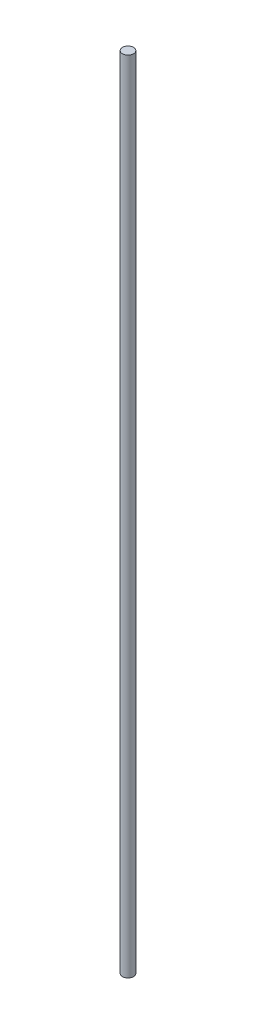
ISO-10303-21;
HEADER;
FILE_DESCRIPTION(('STEP AP214'),'2;1');
FILE_NAME('part.step','',(''),(''),'','','');
FILE_SCHEMA(('AUTOMOTIVE_DESIGN { 1 0 10303 214 1 1 1 1 }'));
ENDSEC;
DATA;
#1=APPLICATION_CONTEXT('core data for automotive mechanical design processes');
#2=APPLICATION_PROTOCOL_DEFINITION('international standard','automotive_design',2000,#1);
#3=PRODUCT_CONTEXT('',#1,'mechanical');
#4=PRODUCT('Part','Part','',(#3));
#5=PRODUCT_RELATED_PRODUCT_CATEGORY('part','',(#4));
#6=PRODUCT_DEFINITION_FORMATION('','',#4);
#7=PRODUCT_DEFINITION_CONTEXT('part definition',#1,'design');
#8=PRODUCT_DEFINITION('design','',#6,#7);
#9=PRODUCT_DEFINITION_SHAPE('','',#8);
#10=(LENGTH_UNIT() NAMED_UNIT(*) SI_UNIT(.MILLI.,.METRE.));
#11=(NAMED_UNIT(*) PLANE_ANGLE_UNIT() SI_UNIT($,.RADIAN.));
#12=(NAMED_UNIT(*) SI_UNIT($,.STERADIAN.) SOLID_ANGLE_UNIT());
#13=UNCERTAINTY_MEASURE_WITH_UNIT(LENGTH_MEASURE(1.E-05),#10,'distance_accuracy_value','');
#14=(GEOMETRIC_REPRESENTATION_CONTEXT(3) GLOBAL_UNCERTAINTY_ASSIGNED_CONTEXT((#13)) GLOBAL_UNIT_ASSIGNED_CONTEXT((#10,
#11,#12)) REPRESENTATION_CONTEXT('',''));
#15=CARTESIAN_POINT('',(0.,0.,0.));
#16=DIRECTION('',(0.,0.,1.));
#17=DIRECTION('',(1.,0.,0.));
#18=AXIS2_PLACEMENT_3D('',#15,#16,#17);
#19=CARTESIAN_POINT('',(0.,228.6,0.));
#20=DIRECTION('',(0.,-1.,0.));
#21=DIRECTION('',(0.,0.,-1.));
#22=AXIS2_PLACEMENT_3D('',#19,#20,#21);
#23=CYLINDRICAL_SURFACE('',#22,1.5875);
#24=CARTESIAN_POINT('',(0.,228.6,0.));
#25=DIRECTION('',(0.,1.,0.));
#26=DIRECTION('',(0.,0.,1.));
#27=AXIS2_PLACEMENT_3D('',#24,#25,#26);
#28=CIRCLE('',#27,1.5875);
#29=CARTESIAN_POINT('',(0.,228.6,1.5875));
#30=VERTEX_POINT('',#29);
#31=EDGE_CURVE('E10',#30,#30,#28,.T.);
#32=ORIENTED_EDGE('',*,*,#31,.F.);
#33=EDGE_LOOP('',(#32));
#34=FACE_BOUND('',#33,.T.);
#35=CARTESIAN_POINT('',(0.,0.,0.));
#36=DIRECTION('',(0.,1.,0.));
#37=DIRECTION('',(0.,0.,1.));
#38=AXIS2_PLACEMENT_3D('',#35,#36,#37);
#39=CIRCLE('',#38,1.5875);
#40=CARTESIAN_POINT('',(0.,0.,1.5875));
#41=VERTEX_POINT('',#40);
#42=EDGE_CURVE('E34',#41,#41,#39,.T.);
#43=ORIENTED_EDGE('',*,*,#42,.T.);
#44=EDGE_LOOP('',(#43));
#45=FACE_BOUND('',#44,.T.);
#46=ADVANCED_FACE('F31',(#34,#45),#23,.T.);
#47=CARTESIAN_POINT('',(0.,228.6,0.));
#48=DIRECTION('',(0.,1.,0.));
#49=DIRECTION('',(0.,0.,1.));
#50=AXIS2_PLACEMENT_3D('',#47,#48,#49);
#51=PLANE('',#50);
#52=ORIENTED_EDGE('',*,*,#31,.T.);
#53=EDGE_LOOP('',(#52));
#54=FACE_BOUND('',#53,.T.);
#55=ADVANCED_FACE('F46',(#54),#51,.T.);
#56=CARTESIAN_POINT('',(0.,0.,0.));
#57=DIRECTION('',(0.,1.,0.));
#58=DIRECTION('',(0.,0.,1.));
#59=AXIS2_PLACEMENT_3D('',#56,#57,#58);
#60=PLANE('',#59);
#61=ORIENTED_EDGE('',*,*,#42,.F.);
#62=EDGE_LOOP('',(#61));
#63=FACE_BOUND('',#62,.T.);
#64=ADVANCED_FACE('F44',(#63),#60,.F.);
#65=CLOSED_SHELL('',(#46,#55,#64));
#66=MANIFOLD_SOLID_BREP('B2',#65);
#67=ADVANCED_BREP_SHAPE_REPRESENTATION('',(#18,#66),#14);
#68=SHAPE_DEFINITION_REPRESENTATION(#9,#67);
ENDSEC;
END-ISO-10303-21;
